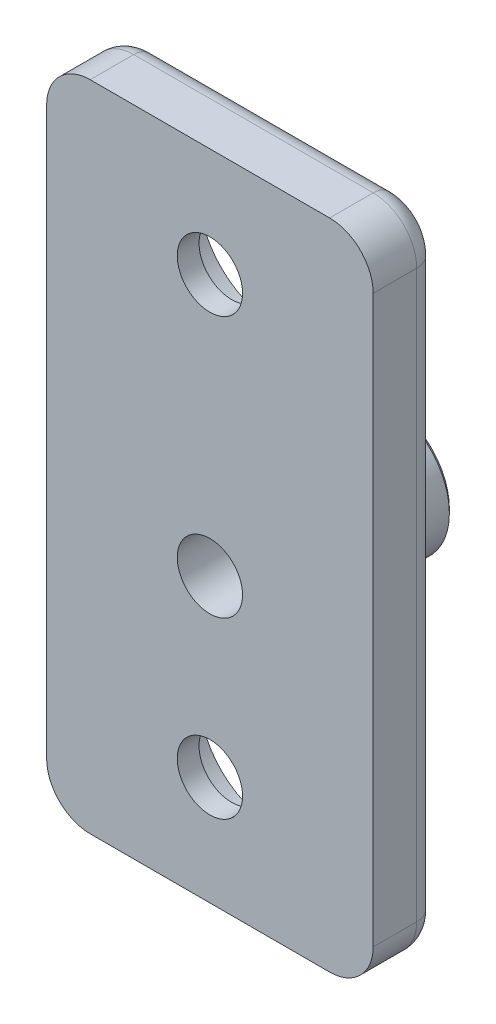
ISO-10303-21;
HEADER;
FILE_DESCRIPTION(('STEP AP214'),'2;1');
FILE_NAME('part.step','',(''),(''),'','','');
FILE_SCHEMA(('AUTOMOTIVE_DESIGN { 1 0 10303 214 1 1 1 1 }'));
ENDSEC;
DATA;
#1=APPLICATION_CONTEXT('core data for automotive mechanical design processes');
#2=APPLICATION_PROTOCOL_DEFINITION('international standard','automotive_design',2000,#1);
#3=PRODUCT_CONTEXT('',#1,'mechanical');
#4=PRODUCT('Part','Part','',(#3));
#5=PRODUCT_RELATED_PRODUCT_CATEGORY('part','',(#4));
#6=PRODUCT_DEFINITION_FORMATION('','',#4);
#7=PRODUCT_DEFINITION_CONTEXT('part definition',#1,'design');
#8=PRODUCT_DEFINITION('design','',#6,#7);
#9=PRODUCT_DEFINITION_SHAPE('','',#8);
#10=(LENGTH_UNIT() NAMED_UNIT(*) SI_UNIT(.MILLI.,.METRE.));
#11=(NAMED_UNIT(*) PLANE_ANGLE_UNIT() SI_UNIT($,.RADIAN.));
#12=(NAMED_UNIT(*) SI_UNIT($,.STERADIAN.) SOLID_ANGLE_UNIT());
#13=UNCERTAINTY_MEASURE_WITH_UNIT(LENGTH_MEASURE(1.E-05),#10,'distance_accuracy_value','');
#14=(GEOMETRIC_REPRESENTATION_CONTEXT(3) GLOBAL_UNCERTAINTY_ASSIGNED_CONTEXT((#13)) GLOBAL_UNIT_ASSIGNED_CONTEXT((#10,
#11,#12)) REPRESENTATION_CONTEXT('',''));
#15=CARTESIAN_POINT('',(0.,0.,0.));
#16=DIRECTION('',(0.,0.,1.));
#17=DIRECTION('',(1.,0.,0.));
#18=AXIS2_PLACEMENT_3D('',#15,#16,#17);
#19=CARTESIAN_POINT('',(0.,0.,3.));
#20=DIRECTION('',(1.,0.,0.));
#21=DIRECTION('',(0.,0.,-1.));
#22=AXIS2_PLACEMENT_3D('',#19,#20,#21);
#23=PLANE('',#22);
#24=DIRECTION('',(0.,0.,-1.));
#25=VECTOR('',#24,1.);
#26=CARTESIAN_POINT('',(0.,28.,3.));
#27=LINE('',#26,#25);
#28=CARTESIAN_POINT('',(0.,28.,3.));
#29=VERTEX_POINT('',#28);
#30=CARTESIAN_POINT('',(0.,28.,1.));
#31=VERTEX_POINT('',#30);
#32=EDGE_CURVE('E181',#29,#31,#27,.T.);
#33=ORIENTED_EDGE('',*,*,#32,.T.);
#34=DIRECTION('',(0.,-1.,0.));
#35=VECTOR('',#34,1.);
#36=CARTESIAN_POINT('',(0.,2.,1.));
#37=LINE('',#36,#35);
#38=CARTESIAN_POINT('',(0.,2.,1.));
#39=VERTEX_POINT('',#38);
#40=EDGE_CURVE('E223',#31,#39,#37,.T.);
#41=ORIENTED_EDGE('',*,*,#40,.T.);
#42=DIRECTION('',(0.,0.,-1.));
#43=VECTOR('',#42,1.);
#44=CARTESIAN_POINT('',(0.,2.,3.));
#45=LINE('',#44,#43);
#46=CARTESIAN_POINT('',(0.,2.,3.));
#47=VERTEX_POINT('',#46);
#48=EDGE_CURVE('E185',#39,#47,#45,.F.);
#49=ORIENTED_EDGE('',*,*,#48,.T.);
#50=DIRECTION('',(0.,-1.,0.));
#51=VECTOR('',#50,1.);
#52=CARTESIAN_POINT('',(0.,0.,3.));
#53=LINE('',#52,#51);
#54=EDGE_CURVE('E364',#29,#47,#53,.T.);
#55=ORIENTED_EDGE('',*,*,#54,.F.);
#56=EDGE_LOOP('',(#33,#41,#49,#55));
#57=FACE_BOUND('',#56,.T.);
#58=ADVANCED_FACE('F41',(#57),#23,.F.);
#59=CARTESIAN_POINT('',(0.,0.,3.));
#60=DIRECTION('',(0.,1.,0.));
#61=DIRECTION('',(0.,0.,1.));
#62=AXIS2_PLACEMENT_3D('',#59,#60,#61);
#63=PLANE('',#62);
#64=DIRECTION('',(0.,0.,-1.));
#65=VECTOR('',#64,1.);
#66=CARTESIAN_POINT('',(2.,0.,3.));
#67=LINE('',#66,#65);
#68=CARTESIAN_POINT('',(2.,0.,3.));
#69=VERTEX_POINT('',#68);
#70=CARTESIAN_POINT('',(2.,0.,1.));
#71=VERTEX_POINT('',#70);
#72=EDGE_CURVE('E142',#69,#71,#67,.T.);
#73=ORIENTED_EDGE('',*,*,#72,.T.);
#74=DIRECTION('',(1.,0.,0.));
#75=VECTOR('',#74,1.);
#76=CARTESIAN_POINT('',(13.,0.,1.));
#77=LINE('',#76,#75);
#78=CARTESIAN_POINT('',(13.,0.,1.));
#79=VERTEX_POINT('',#78);
#80=EDGE_CURVE('E217',#71,#79,#77,.T.);
#81=ORIENTED_EDGE('',*,*,#80,.T.);
#82=DIRECTION('',(0.,0.,-1.));
#83=VECTOR('',#82,1.);
#84=CARTESIAN_POINT('',(13.,0.,3.));
#85=LINE('',#84,#83);
#86=CARTESIAN_POINT('',(13.,0.,3.));
#87=VERTEX_POINT('',#86);
#88=EDGE_CURVE('E178',#79,#87,#85,.F.);
#89=ORIENTED_EDGE('',*,*,#88,.T.);
#90=DIRECTION('',(1.,0.,0.));
#91=VECTOR('',#90,1.);
#92=CARTESIAN_POINT('',(0.,0.,3.));
#93=LINE('',#92,#91);
#94=EDGE_CURVE('E362',#69,#87,#93,.T.);
#95=ORIENTED_EDGE('',*,*,#94,.F.);
#96=EDGE_LOOP('',(#73,#81,#89,#95));
#97=FACE_BOUND('',#96,.T.);
#98=ADVANCED_FACE('F289',(#97),#63,.F.);
#99=CARTESIAN_POINT('',(15.,0.,3.));
#100=DIRECTION('',(-1.,0.,0.));
#101=DIRECTION('',(0.,0.,1.));
#102=AXIS2_PLACEMENT_3D('',#99,#100,#101);
#103=PLANE('',#102);
#104=DIRECTION('',(0.,0.,-1.));
#105=VECTOR('',#104,1.);
#106=CARTESIAN_POINT('',(15.,2.,3.));
#107=LINE('',#106,#105);
#108=CARTESIAN_POINT('',(15.,2.,3.));
#109=VERTEX_POINT('',#108);
#110=CARTESIAN_POINT('',(15.,2.,1.));
#111=VERTEX_POINT('',#110);
#112=EDGE_CURVE('E156',#109,#111,#107,.T.);
#113=ORIENTED_EDGE('',*,*,#112,.T.);
#114=DIRECTION('',(0.,1.,0.));
#115=VECTOR('',#114,1.);
#116=CARTESIAN_POINT('',(15.,28.,1.));
#117=LINE('',#116,#115);
#118=CARTESIAN_POINT('',(15.,28.,1.));
#119=VERTEX_POINT('',#118);
#120=EDGE_CURVE('E57',#111,#119,#117,.T.);
#121=ORIENTED_EDGE('',*,*,#120,.T.);
#122=DIRECTION('',(0.,0.,-1.));
#123=VECTOR('',#122,1.);
#124=CARTESIAN_POINT('',(15.,28.,3.));
#125=LINE('',#124,#123);
#126=CARTESIAN_POINT('',(15.,28.,3.));
#127=VERTEX_POINT('',#126);
#128=EDGE_CURVE('E160',#119,#127,#125,.F.);
#129=ORIENTED_EDGE('',*,*,#128,.T.);
#130=DIRECTION('',(0.,1.,0.));
#131=VECTOR('',#130,1.);
#132=CARTESIAN_POINT('',(15.,0.,3.));
#133=LINE('',#132,#131);
#134=EDGE_CURVE('E140',#109,#127,#133,.T.);
#135=ORIENTED_EDGE('',*,*,#134,.F.);
#136=EDGE_LOOP('',(#113,#121,#129,#135));
#137=FACE_BOUND('',#136,.T.);
#138=ADVANCED_FACE('F295',(#137),#103,.F.);
#139=CARTESIAN_POINT('',(0.,30.,3.));
#140=DIRECTION('',(0.,-1.,0.));
#141=DIRECTION('',(0.,0.,-1.));
#142=AXIS2_PLACEMENT_3D('',#139,#140,#141);
#143=PLANE('',#142);
#144=DIRECTION('',(0.,0.,-1.));
#145=VECTOR('',#144,1.);
#146=CARTESIAN_POINT('',(13.,30.,3.));
#147=LINE('',#146,#145);
#148=CARTESIAN_POINT('',(13.,30.,3.));
#149=VERTEX_POINT('',#148);
#150=CARTESIAN_POINT('',(13.,30.,1.));
#151=VERTEX_POINT('',#150);
#152=EDGE_CURVE('E147',#149,#151,#147,.T.);
#153=ORIENTED_EDGE('',*,*,#152,.T.);
#154=DIRECTION('',(-1.,0.,0.));
#155=VECTOR('',#154,1.);
#156=CARTESIAN_POINT('',(2.,30.,1.));
#157=LINE('',#156,#155);
#158=CARTESIAN_POINT('',(2.,30.,1.));
#159=VERTEX_POINT('',#158);
#160=EDGE_CURVE('E229',#151,#159,#157,.T.);
#161=ORIENTED_EDGE('',*,*,#160,.T.);
#162=DIRECTION('',(0.,0.,-1.));
#163=VECTOR('',#162,1.);
#164=CARTESIAN_POINT('',(2.,30.,3.));
#165=LINE('',#164,#163);
#166=CARTESIAN_POINT('',(2.,30.,3.));
#167=VERTEX_POINT('',#166);
#168=EDGE_CURVE('E150',#159,#167,#165,.F.);
#169=ORIENTED_EDGE('',*,*,#168,.T.);
#170=DIRECTION('',(-1.,0.,0.));
#171=VECTOR('',#170,1.);
#172=CARTESIAN_POINT('',(0.,30.,3.));
#173=LINE('',#172,#171);
#174=EDGE_CURVE('E137',#149,#167,#173,.T.);
#175=ORIENTED_EDGE('',*,*,#174,.F.);
#176=EDGE_LOOP('',(#153,#161,#169,#175));
#177=FACE_BOUND('',#176,.T.);
#178=ADVANCED_FACE('F146',(#177),#143,.F.);
#179=CARTESIAN_POINT('',(0.,0.,3.));
#180=DIRECTION('',(0.,0.,-1.));
#181=DIRECTION('',(-1.,0.,0.));
#182=AXIS2_PLACEMENT_3D('',#179,#180,#181);
#183=PLANE('',#182);
#184=CARTESIAN_POINT('',(7.5,13.,3.));
#185=DIRECTION('',(0.,0.,-1.));
#186=DIRECTION('',(-1.,0.,0.));
#187=AXIS2_PLACEMENT_3D('',#184,#185,#186);
#188=CIRCLE('',#187,1.5);
#189=CARTESIAN_POINT('',(6.,13.,3.));
#190=VERTEX_POINT('',#189);
#191=EDGE_CURVE('E240',#190,#190,#188,.F.);
#192=ORIENTED_EDGE('',*,*,#191,.F.);
#193=EDGE_LOOP('',(#192));
#194=FACE_BOUND('',#193,.T.);
#195=CARTESIAN_POINT('',(7.5,25.,3.));
#196=DIRECTION('',(0.,0.,1.));
#197=DIRECTION('',(1.,0.,0.));
#198=AXIS2_PLACEMENT_3D('',#195,#196,#197);
#199=CIRCLE('',#198,1.5);
#200=CARTESIAN_POINT('',(9.,25.,3.));
#201=VERTEX_POINT('',#200);
#202=EDGE_CURVE('E372',#201,#201,#199,.T.);
#203=ORIENTED_EDGE('',*,*,#202,.F.);
#204=EDGE_LOOP('',(#203));
#205=FACE_BOUND('',#204,.T.);
#206=CARTESIAN_POINT('',(7.5,5.,3.));
#207=DIRECTION('',(0.,0.,1.));
#208=DIRECTION('',(1.,0.,0.));
#209=AXIS2_PLACEMENT_3D('',#206,#207,#208);
#210=CIRCLE('',#209,1.5);
#211=CARTESIAN_POINT('',(9.,5.,3.));
#212=VERTEX_POINT('',#211);
#213=EDGE_CURVE('E384',#212,#212,#210,.T.);
#214=ORIENTED_EDGE('',*,*,#213,.F.);
#215=EDGE_LOOP('',(#214));
#216=FACE_BOUND('',#215,.T.);
#217=ORIENTED_EDGE('',*,*,#134,.T.);
#218=CARTESIAN_POINT('',(13.,28.,3.));
#219=DIRECTION('',(0.,0.,-1.));
#220=DIRECTION('',(-1.,0.,0.));
#221=AXIS2_PLACEMENT_3D('',#218,#219,#220);
#222=CIRCLE('',#221,2.);
#223=EDGE_CURVE('E134',#127,#149,#222,.F.);
#224=ORIENTED_EDGE('',*,*,#223,.T.);
#225=ORIENTED_EDGE('',*,*,#174,.T.);
#226=CARTESIAN_POINT('',(2.,28.,3.));
#227=DIRECTION('',(0.,0.,-1.));
#228=DIRECTION('',(-1.,0.,0.));
#229=AXIS2_PLACEMENT_3D('',#226,#227,#228);
#230=CIRCLE('',#229,2.);
#231=EDGE_CURVE('E167',#167,#29,#230,.F.);
#232=ORIENTED_EDGE('',*,*,#231,.T.);
#233=ORIENTED_EDGE('',*,*,#54,.T.);
#234=CARTESIAN_POINT('',(2.,2.,3.));
#235=DIRECTION('',(0.,0.,-1.));
#236=DIRECTION('',(-1.,0.,0.));
#237=AXIS2_PLACEMENT_3D('',#234,#235,#236);
#238=CIRCLE('',#237,2.);
#239=EDGE_CURVE('E170',#47,#69,#238,.F.);
#240=ORIENTED_EDGE('',*,*,#239,.T.);
#241=ORIENTED_EDGE('',*,*,#94,.T.);
#242=CARTESIAN_POINT('',(13.,2.,3.));
#243=DIRECTION('',(0.,0.,-1.));
#244=DIRECTION('',(-1.,0.,0.));
#245=AXIS2_PLACEMENT_3D('',#242,#243,#244);
#246=CIRCLE('',#245,2.);
#247=EDGE_CURVE('E143',#87,#109,#246,.F.);
#248=ORIENTED_EDGE('',*,*,#247,.T.);
#249=EDGE_LOOP('',(#217,#224,#225,#232,#233,#240,#241,#248));
#250=FACE_BOUND('',#249,.T.);
#251=ADVANCED_FACE('F136',(#194,#205,#216,#250),#183,.F.);
#252=CARTESIAN_POINT('',(0.,0.,0.));
#253=DIRECTION('',(0.,0.,-1.));
#254=DIRECTION('',(-1.,0.,0.));
#255=AXIS2_PLACEMENT_3D('',#252,#253,#254);
#256=PLANE('',#255);
#257=DIRECTION('',(0.,1.,0.));
#258=VECTOR('',#257,1.);
#259=CARTESIAN_POINT('',(14.,2.,0.));
#260=LINE('',#259,#258);
#261=CARTESIAN_POINT('',(14.,28.,0.));
#262=VERTEX_POINT('',#261);
#263=CARTESIAN_POINT('',(14.,2.,0.));
#264=VERTEX_POINT('',#263);
#265=EDGE_CURVE('E188',#262,#264,#260,.F.);
#266=ORIENTED_EDGE('',*,*,#265,.T.);
#267=CARTESIAN_POINT('',(13.,2.,0.));
#268=DIRECTION('',(0.,0.,-1.));
#269=DIRECTION('',(-1.,0.,0.));
#270=AXIS2_PLACEMENT_3D('',#267,#268,#269);
#271=CIRCLE('',#270,1.);
#272=CARTESIAN_POINT('',(13.,1.,0.));
#273=VERTEX_POINT('',#272);
#274=EDGE_CURVE('E209',#264,#273,#271,.T.);
#275=ORIENTED_EDGE('',*,*,#274,.T.);
#276=DIRECTION('',(1.,0.,0.));
#277=VECTOR('',#276,1.);
#278=CARTESIAN_POINT('',(2.,1.,0.));
#279=LINE('',#278,#277);
#280=CARTESIAN_POINT('',(2.,1.,0.));
#281=VERTEX_POINT('',#280);
#282=EDGE_CURVE('E206',#273,#281,#279,.F.);
#283=ORIENTED_EDGE('',*,*,#282,.T.);
#284=CARTESIAN_POINT('',(2.,2.,0.));
#285=DIRECTION('',(0.,0.,-1.));
#286=DIRECTION('',(-1.,0.,0.));
#287=AXIS2_PLACEMENT_3D('',#284,#285,#286);
#288=CIRCLE('',#287,1.);
#289=CARTESIAN_POINT('',(1.,2.,0.));
#290=VERTEX_POINT('',#289);
#291=EDGE_CURVE('E203',#281,#290,#288,.T.);
#292=ORIENTED_EDGE('',*,*,#291,.T.);
#293=DIRECTION('',(0.,-1.,0.));
#294=VECTOR('',#293,1.);
#295=CARTESIAN_POINT('',(1.,28.,0.));
#296=LINE('',#295,#294);
#297=CARTESIAN_POINT('',(1.,28.,0.));
#298=VERTEX_POINT('',#297);
#299=EDGE_CURVE('E200',#290,#298,#296,.F.);
#300=ORIENTED_EDGE('',*,*,#299,.T.);
#301=CARTESIAN_POINT('',(2.,28.,0.));
#302=DIRECTION('',(0.,0.,-1.));
#303=DIRECTION('',(-1.,0.,0.));
#304=AXIS2_PLACEMENT_3D('',#301,#302,#303);
#305=CIRCLE('',#304,1.);
#306=CARTESIAN_POINT('',(2.,29.,0.));
#307=VERTEX_POINT('',#306);
#308=EDGE_CURVE('E197',#298,#307,#305,.T.);
#309=ORIENTED_EDGE('',*,*,#308,.T.);
#310=DIRECTION('',(-1.,0.,0.));
#311=VECTOR('',#310,1.);
#312=CARTESIAN_POINT('',(13.,29.,0.));
#313=LINE('',#312,#311);
#314=CARTESIAN_POINT('',(13.,29.,0.));
#315=VERTEX_POINT('',#314);
#316=EDGE_CURVE('E194',#307,#315,#313,.F.);
#317=ORIENTED_EDGE('',*,*,#316,.T.);
#318=CARTESIAN_POINT('',(13.,28.,0.));
#319=DIRECTION('',(0.,0.,-1.));
#320=DIRECTION('',(-1.,0.,0.));
#321=AXIS2_PLACEMENT_3D('',#318,#319,#320);
#322=CIRCLE('',#321,1.);
#323=EDGE_CURVE('E191',#315,#262,#322,.T.);
#324=ORIENTED_EDGE('',*,*,#323,.T.);
#325=EDGE_LOOP('',(#266,#275,#283,#292,#300,#309,#317,#324));
#326=FACE_BOUND('',#325,.T.);
#327=CARTESIAN_POINT('',(7.5,13.,0.));
#328=DIRECTION('',(0.,0.,-1.));
#329=DIRECTION('',(-1.,0.,0.));
#330=AXIS2_PLACEMENT_3D('',#327,#328,#329);
#331=CIRCLE('',#330,3.);
#332=CARTESIAN_POINT('',(4.5,13.,0.));
#333=VERTEX_POINT('',#332);
#334=EDGE_CURVE('E152',#333,#333,#331,.T.);
#335=ORIENTED_EDGE('',*,*,#334,.F.);
#336=EDGE_LOOP('',(#335));
#337=FACE_BOUND('',#336,.T.);
#338=CARTESIAN_POINT('',(7.5,25.,0.));
#339=DIRECTION('',(0.,0.,1.));
#340=DIRECTION('',(1.,0.,0.));
#341=AXIS2_PLACEMENT_3D('',#338,#339,#340);
#342=CIRCLE('',#341,3.5);
#343=CARTESIAN_POINT('',(11.,25.,0.));
#344=VERTEX_POINT('',#343);
#345=EDGE_CURVE('E398',#344,#344,#342,.T.);
#346=ORIENTED_EDGE('',*,*,#345,.T.);
#347=EDGE_LOOP('',(#346));
#348=FACE_BOUND('',#347,.T.);
#349=CARTESIAN_POINT('',(7.5,5.,0.));
#350=DIRECTION('',(0.,0.,1.));
#351=DIRECTION('',(1.,0.,0.));
#352=AXIS2_PLACEMENT_3D('',#349,#350,#351);
#353=CIRCLE('',#352,3.5);
#354=CARTESIAN_POINT('',(11.,5.,0.));
#355=VERTEX_POINT('',#354);
#356=EDGE_CURVE('E267',#355,#355,#353,.T.);
#357=ORIENTED_EDGE('',*,*,#356,.T.);
#358=EDGE_LOOP('',(#357));
#359=FACE_BOUND('',#358,.T.);
#360=ADVANCED_FACE('F389',(#326,#337,#348,#359),#256,.T.);
#361=CARTESIAN_POINT('',(7.5,5.,3.));
#362=DIRECTION('',(0.,0.,-1.));
#363=DIRECTION('',(-1.,0.,0.));
#364=AXIS2_PLACEMENT_3D('',#361,#362,#363);
#365=CYLINDRICAL_SURFACE('',#364,1.5);
#366=CARTESIAN_POINT('',(7.5,5.,2.));
#367=DIRECTION('',(0.,0.,1.));
#368=DIRECTION('',(1.,0.,0.));
#369=AXIS2_PLACEMENT_3D('',#366,#367,#368);
#370=CIRCLE('',#369,1.5);
#371=CARTESIAN_POINT('',(9.,5.,2.));
#372=VERTEX_POINT('',#371);
#373=EDGE_CURVE('E380',#372,#372,#370,.T.);
#374=ORIENTED_EDGE('',*,*,#373,.F.);
#375=EDGE_LOOP('',(#374));
#376=FACE_BOUND('',#375,.T.);
#377=ORIENTED_EDGE('',*,*,#213,.T.);
#378=EDGE_LOOP('',(#377));
#379=FACE_BOUND('',#378,.T.);
#380=ADVANCED_FACE('F392',(#376,#379),#365,.F.);
#381=CARTESIAN_POINT('',(7.5,25.,3.));
#382=DIRECTION('',(0.,0.,-1.));
#383=DIRECTION('',(-1.,0.,0.));
#384=AXIS2_PLACEMENT_3D('',#381,#382,#383);
#385=CYLINDRICAL_SURFACE('',#384,1.5);
#386=CARTESIAN_POINT('',(7.5,25.,2.));
#387=DIRECTION('',(0.,0.,1.));
#388=DIRECTION('',(1.,0.,0.));
#389=AXIS2_PLACEMENT_3D('',#386,#387,#388);
#390=CIRCLE('',#389,1.5);
#391=CARTESIAN_POINT('',(9.,25.,2.));
#392=VERTEX_POINT('',#391);
#393=EDGE_CURVE('E376',#392,#392,#390,.T.);
#394=ORIENTED_EDGE('',*,*,#393,.F.);
#395=EDGE_LOOP('',(#394));
#396=FACE_BOUND('',#395,.T.);
#397=ORIENTED_EDGE('',*,*,#202,.T.);
#398=EDGE_LOOP('',(#397));
#399=FACE_BOUND('',#398,.T.);
#400=ADVANCED_FACE('F580',(#396,#399),#385,.F.);
#401=CARTESIAN_POINT('',(7.5,25.,2.));
#402=DIRECTION('',(0.,0.,-1.));
#403=DIRECTION('',(-1.,0.,0.));
#404=AXIS2_PLACEMENT_3D('',#401,#402,#403);
#405=CYLINDRICAL_SURFACE('',#404,3.5);
#406=CARTESIAN_POINT('',(7.5,25.,2.));
#407=DIRECTION('',(0.,0.,1.));
#408=DIRECTION('',(1.,0.,0.));
#409=AXIS2_PLACEMENT_3D('',#406,#407,#408);
#410=CIRCLE('',#409,3.5);
#411=CARTESIAN_POINT('',(11.,25.,2.));
#412=VERTEX_POINT('',#411);
#413=EDGE_CURVE('E381',#412,#412,#410,.T.);
#414=ORIENTED_EDGE('',*,*,#413,.T.);
#415=EDGE_LOOP('',(#414));
#416=FACE_BOUND('',#415,.T.);
#417=ORIENTED_EDGE('',*,*,#345,.F.);
#418=EDGE_LOOP('',(#417));
#419=FACE_BOUND('',#418,.T.);
#420=ADVANCED_FACE('F576',(#416,#419),#405,.F.);
#421=CARTESIAN_POINT('',(7.5,25.,2.));
#422=DIRECTION('',(0.,0.,1.));
#423=DIRECTION('',(1.,0.,0.));
#424=AXIS2_PLACEMENT_3D('',#421,#422,#423);
#425=PLANE('',#424);
#426=ORIENTED_EDGE('',*,*,#393,.T.);
#427=EDGE_LOOP('',(#426));
#428=FACE_BOUND('',#427,.T.);
#429=ORIENTED_EDGE('',*,*,#413,.F.);
#430=EDGE_LOOP('',(#429));
#431=FACE_BOUND('',#430,.T.);
#432=ADVANCED_FACE('F572',(#428,#431),#425,.F.);
#433=CARTESIAN_POINT('',(7.5,5.,2.));
#434=DIRECTION('',(0.,0.,-1.));
#435=DIRECTION('',(-1.,0.,0.));
#436=AXIS2_PLACEMENT_3D('',#433,#434,#435);
#437=CYLINDRICAL_SURFACE('',#436,3.5);
#438=CARTESIAN_POINT('',(7.5,5.,2.));
#439=DIRECTION('',(0.,0.,1.));
#440=DIRECTION('',(1.,0.,0.));
#441=AXIS2_PLACEMENT_3D('',#438,#439,#440);
#442=CIRCLE('',#441,3.5);
#443=CARTESIAN_POINT('',(11.,5.,2.));
#444=VERTEX_POINT('',#443);
#445=EDGE_CURVE('E403',#444,#444,#442,.T.);
#446=ORIENTED_EDGE('',*,*,#445,.T.);
#447=EDGE_LOOP('',(#446));
#448=FACE_BOUND('',#447,.T.);
#449=ORIENTED_EDGE('',*,*,#356,.F.);
#450=EDGE_LOOP('',(#449));
#451=FACE_BOUND('',#450,.T.);
#452=ADVANCED_FACE('F575',(#448,#451),#437,.F.);
#453=CARTESIAN_POINT('',(7.5,5.,2.));
#454=DIRECTION('',(0.,0.,1.));
#455=DIRECTION('',(1.,0.,0.));
#456=AXIS2_PLACEMENT_3D('',#453,#454,#455);
#457=PLANE('',#456);
#458=ORIENTED_EDGE('',*,*,#373,.T.);
#459=EDGE_LOOP('',(#458));
#460=FACE_BOUND('',#459,.T.);
#461=ORIENTED_EDGE('',*,*,#445,.F.);
#462=EDGE_LOOP('',(#461));
#463=FACE_BOUND('',#462,.T.);
#464=ADVANCED_FACE('F554',(#460,#463),#457,.F.);
#465=CARTESIAN_POINT('',(7.5,13.,-5.2));
#466=DIRECTION('',(0.,0.,1.));
#467=DIRECTION('',(1.,0.,0.));
#468=AXIS2_PLACEMENT_3D('',#465,#466,#467);
#469=CYLINDRICAL_SURFACE('',#468,3.);
#470=CARTESIAN_POINT('',(7.5,13.,-5.00000000000001));
#471=DIRECTION('',(0.,0.,1.));
#472=DIRECTION('',(1.,0.,0.));
#473=AXIS2_PLACEMENT_3D('',#470,#471,#472);
#474=CIRCLE('',#473,3.);
#475=CARTESIAN_POINT('',(10.5,13.,-5.00000000000001));
#476=VERTEX_POINT('',#475);
#477=EDGE_CURVE('E50',#476,#476,#474,.T.);
#478=ORIENTED_EDGE('',*,*,#477,.T.);
#479=EDGE_LOOP('',(#478));
#480=FACE_BOUND('',#479,.T.);
#481=ORIENTED_EDGE('',*,*,#334,.T.);
#482=EDGE_LOOP('',(#481));
#483=FACE_BOUND('',#482,.T.);
#484=ADVANCED_FACE('F275',(#480,#483),#469,.T.);
#485=CARTESIAN_POINT('',(7.5,13.,-5.2));
#486=DIRECTION('',(0.,0.,1.));
#487=DIRECTION('',(1.,0.,0.));
#488=AXIS2_PLACEMENT_3D('',#485,#486,#487);
#489=PLANE('',#488);
#490=CARTESIAN_POINT('',(7.5,13.,-5.2));
#491=DIRECTION('',(0.,0.,1.));
#492=DIRECTION('',(1.,0.,0.));
#493=AXIS2_PLACEMENT_3D('',#490,#491,#492);
#494=CIRCLE('',#493,2.8);
#495=CARTESIAN_POINT('',(10.3,13.,-5.2));
#496=VERTEX_POINT('',#495);
#497=EDGE_CURVE('E11',#496,#496,#494,.F.);
#498=ORIENTED_EDGE('',*,*,#497,.T.);
#499=EDGE_LOOP('',(#498));
#500=FACE_BOUND('',#499,.T.);
#501=CARTESIAN_POINT('',(7.5,13.,-5.2));
#502=DIRECTION('',(0.,0.,1.));
#503=DIRECTION('',(1.,0.,0.));
#504=AXIS2_PLACEMENT_3D('',#501,#502,#503);
#505=CIRCLE('',#504,1.5);
#506=CARTESIAN_POINT('',(9.,13.,-5.2));
#507=VERTEX_POINT('',#506);
#508=EDGE_CURVE('E268',#507,#507,#505,.F.);
#509=ORIENTED_EDGE('',*,*,#508,.F.);
#510=EDGE_LOOP('',(#509));
#511=FACE_BOUND('',#510,.T.);
#512=ADVANCED_FACE('F303',(#500,#511),#489,.F.);
#513=CARTESIAN_POINT('',(13.,28.,3.));
#514=DIRECTION('',(0.,0.,-1.));
#515=DIRECTION('',(-1.,0.,0.));
#516=AXIS2_PLACEMENT_3D('',#513,#514,#515);
#517=CYLINDRICAL_SURFACE('',#516,2.);
#518=ORIENTED_EDGE('',*,*,#128,.F.);
#519=CARTESIAN_POINT('',(13.,28.,1.));
#520=DIRECTION('',(0.,0.,-1.));
#521=DIRECTION('',(-1.,0.,0.));
#522=AXIS2_PLACEMENT_3D('',#519,#520,#521);
#523=CIRCLE('',#522,2.);
#524=EDGE_CURVE('E64',#119,#151,#523,.F.);
#525=ORIENTED_EDGE('',*,*,#524,.T.);
#526=ORIENTED_EDGE('',*,*,#152,.F.);
#527=ORIENTED_EDGE('',*,*,#223,.F.);
#528=EDGE_LOOP('',(#518,#525,#526,#527));
#529=FACE_BOUND('',#528,.T.);
#530=ADVANCED_FACE('F154',(#529),#517,.T.);
#531=CARTESIAN_POINT('',(13.,2.,3.));
#532=DIRECTION('',(0.,0.,-1.));
#533=DIRECTION('',(-1.,0.,0.));
#534=AXIS2_PLACEMENT_3D('',#531,#532,#533);
#535=CYLINDRICAL_SURFACE('',#534,2.);
#536=ORIENTED_EDGE('',*,*,#88,.F.);
#537=CARTESIAN_POINT('',(13.,2.,1.));
#538=DIRECTION('',(0.,0.,-1.));
#539=DIRECTION('',(-1.,0.,0.));
#540=AXIS2_PLACEMENT_3D('',#537,#538,#539);
#541=CIRCLE('',#540,2.);
#542=EDGE_CURVE('E213',#79,#111,#541,.F.);
#543=ORIENTED_EDGE('',*,*,#542,.T.);
#544=ORIENTED_EDGE('',*,*,#112,.F.);
#545=ORIENTED_EDGE('',*,*,#247,.F.);
#546=EDGE_LOOP('',(#536,#543,#544,#545));
#547=FACE_BOUND('',#546,.T.);
#548=ADVANCED_FACE('F302',(#547),#535,.T.);
#549=CARTESIAN_POINT('',(2.,2.,3.));
#550=DIRECTION('',(0.,0.,-1.));
#551=DIRECTION('',(-1.,0.,0.));
#552=AXIS2_PLACEMENT_3D('',#549,#550,#551);
#553=CYLINDRICAL_SURFACE('',#552,2.);
#554=ORIENTED_EDGE('',*,*,#48,.F.);
#555=CARTESIAN_POINT('',(2.,2.,1.));
#556=DIRECTION('',(0.,0.,-1.));
#557=DIRECTION('',(-1.,0.,0.));
#558=AXIS2_PLACEMENT_3D('',#555,#556,#557);
#559=CIRCLE('',#558,2.);
#560=EDGE_CURVE('E220',#39,#71,#559,.F.);
#561=ORIENTED_EDGE('',*,*,#560,.T.);
#562=ORIENTED_EDGE('',*,*,#72,.F.);
#563=ORIENTED_EDGE('',*,*,#239,.F.);
#564=EDGE_LOOP('',(#554,#561,#562,#563));
#565=FACE_BOUND('',#564,.T.);
#566=ADVANCED_FACE('F306',(#565),#553,.T.);
#567=CARTESIAN_POINT('',(2.,28.,3.));
#568=DIRECTION('',(0.,0.,-1.));
#569=DIRECTION('',(-1.,0.,0.));
#570=AXIS2_PLACEMENT_3D('',#567,#568,#569);
#571=CYLINDRICAL_SURFACE('',#570,2.);
#572=ORIENTED_EDGE('',*,*,#168,.F.);
#573=CARTESIAN_POINT('',(2.,28.,1.));
#574=DIRECTION('',(0.,0.,-1.));
#575=DIRECTION('',(-1.,0.,0.));
#576=AXIS2_PLACEMENT_3D('',#573,#574,#575);
#577=CIRCLE('',#576,2.);
#578=EDGE_CURVE('E226',#159,#31,#577,.F.);
#579=ORIENTED_EDGE('',*,*,#578,.T.);
#580=ORIENTED_EDGE('',*,*,#32,.F.);
#581=ORIENTED_EDGE('',*,*,#231,.F.);
#582=EDGE_LOOP('',(#572,#579,#580,#581));
#583=FACE_BOUND('',#582,.T.);
#584=ADVANCED_FACE('F310',(#583),#571,.T.);
#585=CARTESIAN_POINT('',(2.,28.,1.));
#586=DIRECTION('',(0.,0.,-1.));
#587=DIRECTION('',(-1.,0.,0.));
#588=AXIS2_PLACEMENT_3D('',#585,#586,#587);
#589=DEGENERATE_TOROIDAL_SURFACE('',#588,1.,1.,.T.);
#590=CARTESIAN_POINT('',(1.,28.,1.));
#591=DIRECTION('',(0.,-1.,0.));
#592=DIRECTION('',(0.,0.,-1.));
#593=AXIS2_PLACEMENT_3D('',#590,#591,#592);
#594=CIRCLE('',#593,1.);
#595=EDGE_CURVE('E259',#31,#298,#594,.T.);
#596=ORIENTED_EDGE('',*,*,#595,.F.);
#597=ORIENTED_EDGE('',*,*,#578,.F.);
#598=CARTESIAN_POINT('',(2.,29.,1.));
#599=DIRECTION('',(1.,0.,0.));
#600=DIRECTION('',(0.,0.,-1.));
#601=AXIS2_PLACEMENT_3D('',#598,#599,#600);
#602=CIRCLE('',#601,1.);
#603=EDGE_CURVE('E263',#307,#159,#602,.T.);
#604=ORIENTED_EDGE('',*,*,#603,.F.);
#605=ORIENTED_EDGE('',*,*,#308,.F.);
#606=EDGE_LOOP('',(#596,#597,#604,#605));
#607=FACE_BOUND('',#606,.T.);
#608=ADVANCED_FACE('F314',(#607),#589,.T.);
#609=CARTESIAN_POINT('',(0.,29.,1.));
#610=DIRECTION('',(1.,0.,0.));
#611=DIRECTION('',(0.,0.,-1.));
#612=AXIS2_PLACEMENT_3D('',#609,#610,#611);
#613=CYLINDRICAL_SURFACE('',#612,1.);
#614=ORIENTED_EDGE('',*,*,#603,.T.);
#615=ORIENTED_EDGE('',*,*,#160,.F.);
#616=CARTESIAN_POINT('',(13.,29.,1.));
#617=DIRECTION('',(1.,0.,0.));
#618=DIRECTION('',(0.,0.,-1.));
#619=AXIS2_PLACEMENT_3D('',#616,#617,#618);
#620=CIRCLE('',#619,1.);
#621=EDGE_CURVE('E255',#315,#151,#620,.T.);
#622=ORIENTED_EDGE('',*,*,#621,.F.);
#623=ORIENTED_EDGE('',*,*,#316,.F.);
#624=EDGE_LOOP('',(#614,#615,#622,#623));
#625=FACE_BOUND('',#624,.T.);
#626=ADVANCED_FACE('F338',(#625),#613,.T.);
#627=CARTESIAN_POINT('',(1.,0.,1.));
#628=DIRECTION('',(0.,1.,0.));
#629=DIRECTION('',(0.,0.,1.));
#630=AXIS2_PLACEMENT_3D('',#627,#628,#629);
#631=CYLINDRICAL_SURFACE('',#630,1.);
#632=ORIENTED_EDGE('',*,*,#595,.T.);
#633=ORIENTED_EDGE('',*,*,#299,.F.);
#634=CARTESIAN_POINT('',(1.,2.,1.));
#635=DIRECTION('',(0.,-1.,0.));
#636=DIRECTION('',(0.,0.,-1.));
#637=AXIS2_PLACEMENT_3D('',#634,#635,#636);
#638=CIRCLE('',#637,1.);
#639=EDGE_CURVE('E251',#39,#290,#638,.T.);
#640=ORIENTED_EDGE('',*,*,#639,.F.);
#641=ORIENTED_EDGE('',*,*,#40,.F.);
#642=EDGE_LOOP('',(#632,#633,#640,#641));
#643=FACE_BOUND('',#642,.T.);
#644=ADVANCED_FACE('F334',(#643),#631,.T.);
#645=CARTESIAN_POINT('',(13.,28.,1.));
#646=DIRECTION('',(0.,0.,-1.));
#647=DIRECTION('',(-1.,0.,0.));
#648=AXIS2_PLACEMENT_3D('',#645,#646,#647);
#649=DEGENERATE_TOROIDAL_SURFACE('',#648,1.,1.,.T.);
#650=ORIENTED_EDGE('',*,*,#621,.T.);
#651=ORIENTED_EDGE('',*,*,#524,.F.);
#652=CARTESIAN_POINT('',(14.,28.,1.));
#653=DIRECTION('',(0.,-1.,0.));
#654=DIRECTION('',(0.,0.,-1.));
#655=AXIS2_PLACEMENT_3D('',#652,#653,#654);
#656=CIRCLE('',#655,1.);
#657=EDGE_CURVE('E247',#262,#119,#656,.T.);
#658=ORIENTED_EDGE('',*,*,#657,.F.);
#659=ORIENTED_EDGE('',*,*,#323,.F.);
#660=EDGE_LOOP('',(#650,#651,#658,#659));
#661=FACE_BOUND('',#660,.T.);
#662=ADVANCED_FACE('F330',(#661),#649,.T.);
#663=CARTESIAN_POINT('',(2.,2.,1.));
#664=DIRECTION('',(0.,0.,-1.));
#665=DIRECTION('',(-1.,0.,0.));
#666=AXIS2_PLACEMENT_3D('',#663,#664,#665);
#667=DEGENERATE_TOROIDAL_SURFACE('',#666,1.,1.,.T.);
#668=ORIENTED_EDGE('',*,*,#639,.T.);
#669=ORIENTED_EDGE('',*,*,#291,.F.);
#670=CARTESIAN_POINT('',(2.,1.,1.));
#671=DIRECTION('',(1.,0.,0.));
#672=DIRECTION('',(0.,0.,-1.));
#673=AXIS2_PLACEMENT_3D('',#670,#671,#672);
#674=CIRCLE('',#673,1.);
#675=EDGE_CURVE('E243',#71,#281,#674,.T.);
#676=ORIENTED_EDGE('',*,*,#675,.F.);
#677=ORIENTED_EDGE('',*,*,#560,.F.);
#678=EDGE_LOOP('',(#668,#669,#676,#677));
#679=FACE_BOUND('',#678,.T.);
#680=ADVANCED_FACE('F326',(#679),#667,.T.);
#681=CARTESIAN_POINT('',(14.,0.,1.));
#682=DIRECTION('',(0.,-1.,0.));
#683=DIRECTION('',(0.,0.,-1.));
#684=AXIS2_PLACEMENT_3D('',#681,#682,#683);
#685=CYLINDRICAL_SURFACE('',#684,1.);
#686=ORIENTED_EDGE('',*,*,#657,.T.);
#687=ORIENTED_EDGE('',*,*,#120,.F.);
#688=CARTESIAN_POINT('',(14.,2.,1.));
#689=DIRECTION('',(0.,-1.,0.));
#690=DIRECTION('',(0.,0.,-1.));
#691=AXIS2_PLACEMENT_3D('',#688,#689,#690);
#692=CIRCLE('',#691,1.);
#693=EDGE_CURVE('E239',#264,#111,#692,.T.);
#694=ORIENTED_EDGE('',*,*,#693,.F.);
#695=ORIENTED_EDGE('',*,*,#265,.F.);
#696=EDGE_LOOP('',(#686,#687,#694,#695));
#697=FACE_BOUND('',#696,.T.);
#698=ADVANCED_FACE('F322',(#697),#685,.T.);
#699=CARTESIAN_POINT('',(0.,1.,1.));
#700=DIRECTION('',(-1.,0.,0.));
#701=DIRECTION('',(0.,0.,1.));
#702=AXIS2_PLACEMENT_3D('',#699,#700,#701);
#703=CYLINDRICAL_SURFACE('',#702,1.);
#704=ORIENTED_EDGE('',*,*,#675,.T.);
#705=ORIENTED_EDGE('',*,*,#282,.F.);
#706=CARTESIAN_POINT('',(13.,1.,1.));
#707=DIRECTION('',(1.,0.,0.));
#708=DIRECTION('',(0.,0.,-1.));
#709=AXIS2_PLACEMENT_3D('',#706,#707,#708);
#710=CIRCLE('',#709,1.);
#711=EDGE_CURVE('E236',#79,#273,#710,.T.);
#712=ORIENTED_EDGE('',*,*,#711,.F.);
#713=ORIENTED_EDGE('',*,*,#80,.F.);
#714=EDGE_LOOP('',(#704,#705,#712,#713));
#715=FACE_BOUND('',#714,.T.);
#716=ADVANCED_FACE('F318',(#715),#703,.T.);
#717=CARTESIAN_POINT('',(13.,2.,1.));
#718=DIRECTION('',(0.,0.,-1.));
#719=DIRECTION('',(-1.,0.,0.));
#720=AXIS2_PLACEMENT_3D('',#717,#718,#719);
#721=DEGENERATE_TOROIDAL_SURFACE('',#720,1.,1.,.T.);
#722=ORIENTED_EDGE('',*,*,#693,.T.);
#723=ORIENTED_EDGE('',*,*,#542,.F.);
#724=ORIENTED_EDGE('',*,*,#711,.T.);
#725=ORIENTED_EDGE('',*,*,#274,.F.);
#726=EDGE_LOOP('',(#722,#723,#724,#725));
#727=FACE_BOUND('',#726,.T.);
#728=ADVANCED_FACE('F284',(#727),#721,.T.);
#729=CARTESIAN_POINT('',(7.5,13.,18.));
#730=DIRECTION('',(0.,0.,-1.));
#731=DIRECTION('',(-1.,0.,0.));
#732=AXIS2_PLACEMENT_3D('',#729,#730,#731);
#733=CYLINDRICAL_SURFACE('',#732,1.5);
#734=ORIENTED_EDGE('',*,*,#508,.T.);
#735=EDGE_LOOP('',(#734));
#736=FACE_BOUND('',#735,.T.);
#737=ORIENTED_EDGE('',*,*,#191,.T.);
#738=EDGE_LOOP('',(#737));
#739=FACE_BOUND('',#738,.T.);
#740=ADVANCED_FACE('F279',(#736,#739),#733,.F.);
#741=CARTESIAN_POINT('',(7.5,13.,-5.00000000000001));
#742=DIRECTION('',(0.,0.,1.));
#743=DIRECTION('',(1.,0.,0.));
#744=AXIS2_PLACEMENT_3D('',#741,#742,#743);
#745=CONICAL_SURFACE('',#744,3.,0.785398163397453);
#746=ORIENTED_EDGE('',*,*,#497,.F.);
#747=EDGE_LOOP('',(#746));
#748=FACE_BOUND('',#747,.T.);
#749=ORIENTED_EDGE('',*,*,#477,.F.);
#750=EDGE_LOOP('',(#749));
#751=FACE_BOUND('',#750,.T.);
#752=ADVANCED_FACE('F43',(#748,#751),#745,.T.);
#753=CLOSED_SHELL('',(#58,#98,#138,#178,#251,#360,#380,#400,#420,#432,#452,#464,#484,#512,#530,
#548,#566,#584,#608,#626,#644,#662,#680,#698,#716,#728,#740,#752));
#754=MANIFOLD_SOLID_BREP('B2',#753);
#755=ADVANCED_BREP_SHAPE_REPRESENTATION('',(#18,#754),#14);
#756=SHAPE_DEFINITION_REPRESENTATION(#9,#755);
ENDSEC;
END-ISO-10303-21;
